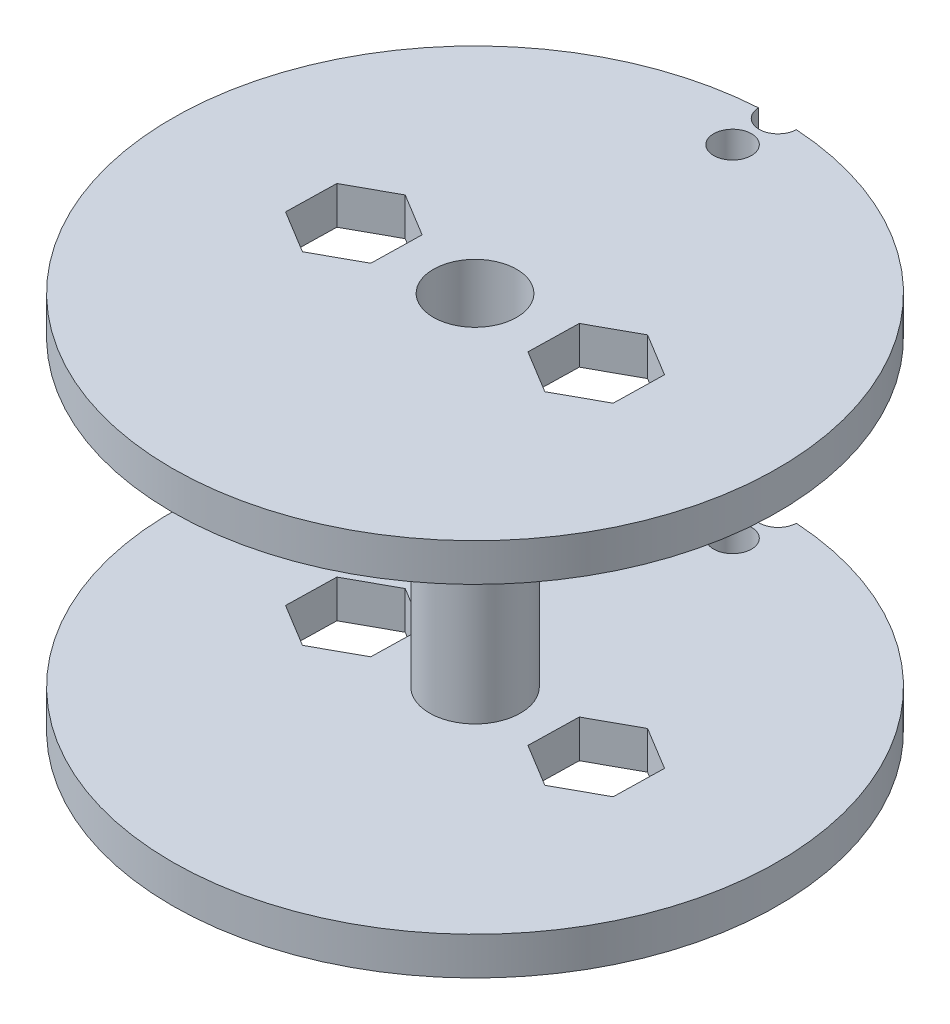
ISO-10303-21;
HEADER;
FILE_DESCRIPTION(('STEP AP214'),'2;1');
FILE_NAME('part.step','',(''),(''),'','','');
FILE_SCHEMA(('AUTOMOTIVE_DESIGN { 1 0 10303 214 1 1 1 1 }'));
ENDSEC;
DATA;
#1=APPLICATION_CONTEXT('core data for automotive mechanical design processes');
#2=APPLICATION_PROTOCOL_DEFINITION('international standard','automotive_design',2000,#1);
#3=PRODUCT_CONTEXT('',#1,'mechanical');
#4=PRODUCT('Part','Part','',(#3));
#5=PRODUCT_RELATED_PRODUCT_CATEGORY('part','',(#4));
#6=PRODUCT_DEFINITION_FORMATION('','',#4);
#7=PRODUCT_DEFINITION_CONTEXT('part definition',#1,'design');
#8=PRODUCT_DEFINITION('design','',#6,#7);
#9=PRODUCT_DEFINITION_SHAPE('','',#8);
#10=(LENGTH_UNIT() NAMED_UNIT(*) SI_UNIT(.MILLI.,.METRE.));
#11=(NAMED_UNIT(*) PLANE_ANGLE_UNIT() SI_UNIT($,.RADIAN.));
#12=(NAMED_UNIT(*) SI_UNIT($,.STERADIAN.) SOLID_ANGLE_UNIT());
#13=UNCERTAINTY_MEASURE_WITH_UNIT(LENGTH_MEASURE(1.E-05),#10,'distance_accuracy_value','');
#14=(GEOMETRIC_REPRESENTATION_CONTEXT(3) GLOBAL_UNCERTAINTY_ASSIGNED_CONTEXT((#13)) GLOBAL_UNIT_ASSIGNED_CONTEXT((#10,
#11,#12)) REPRESENTATION_CONTEXT('',''));
#15=CARTESIAN_POINT('',(0.,0.,0.));
#16=DIRECTION('',(0.,0.,1.));
#17=DIRECTION('',(1.,0.,0.));
#18=AXIS2_PLACEMENT_3D('',#15,#16,#17);
#19=CARTESIAN_POINT('',(0.,2.5,0.));
#20=DIRECTION('',(0.,1.,0.));
#21=DIRECTION('',(0.,0.,1.));
#22=AXIS2_PLACEMENT_3D('',#19,#20,#21);
#23=PLANE('',#22);
#24=DIRECTION('',(-0.0214869779830933,0.,0.999769128237692));
#25=VECTOR('',#24,1.);
#26=CARTESIAN_POINT('',(-5.08999790781407,2.5,-1.59772374233));
#27=LINE('',#26,#25);
#28=CARTESIAN_POINT('',(-5.08999790781407,2.5,-1.59772374233));
#29=VERTEX_POINT('',#28);
#30=CARTESIAN_POINT('',(-5.16132960481908,2.5,1.72127386573417));
#31=VERTEX_POINT('',#30);
#32=EDGE_CURVE('E484',#29,#31,#27,.T.);
#33=ORIENTED_EDGE('',*,*,#32,.T.);
#34=DIRECTION('',(-0.87656895196481,0.,0.48127629533493));
#35=VECTOR('',#34,1.);
#36=CARTESIAN_POINT('',(-5.16132960481908,2.5,1.72127386573417));
#37=LINE('',#36,#35);
#38=CARTESIAN_POINT('',(-8.07133169700495,2.5,3.31899760806487));
#39=VERTEX_POINT('',#38);
#40=EDGE_CURVE('E488',#31,#39,#37,.T.);
#41=ORIENTED_EDGE('',*,*,#40,.T.);
#42=DIRECTION('',(-0.855081973981716,0.,-0.518492832902762));
#43=VECTOR('',#42,1.);
#44=CARTESIAN_POINT('',(-8.07133169700495,2.5,3.31899760806487));
#45=LINE('',#44,#43);
#46=CARTESIAN_POINT('',(-10.9100020921858,2.5,1.59772374233139));
#47=VERTEX_POINT('',#46);
#48=EDGE_CURVE('E493',#39,#47,#45,.T.);
#49=ORIENTED_EDGE('',*,*,#48,.T.);
#50=DIRECTION('',(0.0214869779830943,0.,-0.999769128237692));
#51=VECTOR('',#50,1.);
#52=CARTESIAN_POINT('',(-10.9100020921858,2.5,1.59772374233139));
#53=LINE('',#52,#51);
#54=CARTESIAN_POINT('',(-10.8386703951808,2.5,-1.72127386573279));
#55=VERTEX_POINT('',#54);
#56=EDGE_CURVE('E497',#47,#55,#53,.T.);
#57=ORIENTED_EDGE('',*,*,#56,.T.);
#58=DIRECTION('',(0.87656895196481,0.,-0.48127629533493));
#59=VECTOR('',#58,1.);
#60=CARTESIAN_POINT('',(-10.8386703951808,2.5,-1.72127386573279));
#61=LINE('',#60,#59);
#62=CARTESIAN_POINT('',(-7.92866830299493,2.5,-3.31899760806348));
#63=VERTEX_POINT('',#62);
#64=EDGE_CURVE('E501',#55,#63,#61,.T.);
#65=ORIENTED_EDGE('',*,*,#64,.T.);
#66=DIRECTION('',(0.855081973981716,0.,0.518492832902762));
#67=VECTOR('',#66,1.);
#68=CARTESIAN_POINT('',(-7.92866830299493,2.5,-3.31899760806348));
#69=LINE('',#68,#67);
#70=EDGE_CURVE('E505',#63,#29,#69,.T.);
#71=ORIENTED_EDGE('',*,*,#70,.T.);
#72=EDGE_LOOP('',(#33,#41,#49,#57,#65,#71));
#73=FACE_BOUND('',#72,.T.);
#74=DIRECTION('',(0.0214869779832137,0.,-0.999769128237689));
#75=VECTOR('',#74,1.);
#76=CARTESIAN_POINT('',(5.089997907814,2.5,1.59772374233007));
#77=LINE('',#76,#75);
#78=CARTESIAN_POINT('',(5.089997907814,2.5,1.59772374233007));
#79=VERTEX_POINT('',#78);
#80=CARTESIAN_POINT('',(5.16132960481941,2.5,-1.72127386573409));
#81=VERTEX_POINT('',#80);
#82=EDGE_CURVE('E418',#79,#81,#77,.T.);
#83=ORIENTED_EDGE('',*,*,#82,.T.);
#84=DIRECTION('',(0.876568951964868,0.,-0.481276295334824));
#85=VECTOR('',#84,1.);
#86=CARTESIAN_POINT('',(5.16132960481941,2.5,-1.72127386573409));
#87=LINE('',#86,#85);
#88=CARTESIAN_POINT('',(8.07133169700547,2.5,-3.31899760806444));
#89=VERTEX_POINT('',#88);
#90=EDGE_CURVE('E422',#81,#89,#87,.T.);
#91=ORIENTED_EDGE('',*,*,#90,.T.);
#92=DIRECTION('',(0.855081973981654,0.,0.518492832902865));
#93=VECTOR('',#92,1.);
#94=CARTESIAN_POINT('',(8.07133169700547,2.5,-3.31899760806444));
#95=LINE('',#94,#93);
#96=CARTESIAN_POINT('',(10.9100020921861,2.5,-1.59772374233061));
#97=VERTEX_POINT('',#96);
#98=EDGE_CURVE('E64',#89,#97,#95,.T.);
#99=ORIENTED_EDGE('',*,*,#98,.T.);
#100=DIRECTION('',(-0.021486977983214,0.,0.999769128237689));
#101=VECTOR('',#100,1.);
#102=CARTESIAN_POINT('',(10.9100020921861,2.5,-1.59772374233061));
#103=LINE('',#102,#101);
#104=CARTESIAN_POINT('',(10.8386703951807,2.5,1.72127386573356));
#105=VERTEX_POINT('',#104);
#106=EDGE_CURVE('E429',#97,#105,#103,.T.);
#107=ORIENTED_EDGE('',*,*,#106,.T.);
#108=DIRECTION('',(-0.876568951964868,0.,0.481276295334824));
#109=VECTOR('',#108,1.);
#110=CARTESIAN_POINT('',(10.8386703951807,2.5,1.72127386573356));
#111=LINE('',#110,#109);
#112=CARTESIAN_POINT('',(7.92866830299465,2.5,3.3189976080639));
#113=VERTEX_POINT('',#112);
#114=EDGE_CURVE('E433',#105,#113,#111,.T.);
#115=ORIENTED_EDGE('',*,*,#114,.T.);
#116=DIRECTION('',(-0.855081973981654,0.,-0.518492832902865));
#117=VECTOR('',#116,1.);
#118=CARTESIAN_POINT('',(7.92866830299465,2.5,3.3189976080639));
#119=LINE('',#118,#117);
#120=EDGE_CURVE('E437',#113,#79,#119,.T.);
#121=ORIENTED_EDGE('',*,*,#120,.T.);
#122=EDGE_LOOP('',(#83,#91,#99,#107,#115,#121));
#123=FACE_BOUND('',#122,.T.);
#124=CARTESIAN_POINT('',(0.,2.5,-20.));
#125=DIRECTION('',(0.,1.,0.));
#126=DIRECTION('',(0.,0.,1.));
#127=AXIS2_PLACEMENT_3D('',#124,#125,#126);
#128=CIRCLE('',#127,1.25);
#129=CARTESIAN_POINT('',(-1.24938949935309,2.5,-19.9609375));
#130=VERTEX_POINT('',#129);
#131=CARTESIAN_POINT('',(1.24938949935309,2.5,-19.9609375));
#132=VERTEX_POINT('',#131);
#133=EDGE_CURVE('E409',#130,#132,#128,.T.);
#134=ORIENTED_EDGE('',*,*,#133,.F.);
#135=CARTESIAN_POINT('',(0.,2.5,0.));
#136=DIRECTION('',(0.,1.,0.));
#137=DIRECTION('',(0.,0.,1.));
#138=AXIS2_PLACEMENT_3D('',#135,#136,#137);
#139=CIRCLE('',#138,20.);
#140=EDGE_CURVE('E553',#130,#132,#139,.T.);
#141=ORIENTED_EDGE('',*,*,#140,.T.);
#142=EDGE_LOOP('',(#134,#141));
#143=FACE_BOUND('',#142,.T.);
#144=CARTESIAN_POINT('',(0.,2.5,-17.));
#145=DIRECTION('',(0.,1.,0.));
#146=DIRECTION('',(0.,0.,1.));
#147=AXIS2_PLACEMENT_3D('',#144,#145,#146);
#148=CIRCLE('',#147,1.25);
#149=CARTESIAN_POINT('',(0.,2.5,-15.75));
#150=VERTEX_POINT('',#149);
#151=EDGE_CURVE('E410',#150,#150,#148,.T.);
#152=ORIENTED_EDGE('',*,*,#151,.F.);
#153=EDGE_LOOP('',(#152));
#154=FACE_BOUND('',#153,.T.);
#155=CARTESIAN_POINT('',(0.,2.5,0.));
#156=DIRECTION('',(0.,1.,0.));
#157=DIRECTION('',(0.,0.,1.));
#158=AXIS2_PLACEMENT_3D('',#155,#156,#157);
#159=CIRCLE('',#158,3.);
#160=CARTESIAN_POINT('',(0.,2.5,3.));
#161=VERTEX_POINT('',#160);
#162=EDGE_CURVE('E237',#161,#161,#159,.T.);
#163=ORIENTED_EDGE('',*,*,#162,.F.);
#164=EDGE_LOOP('',(#163));
#165=FACE_BOUND('',#164,.T.);
#166=ADVANCED_FACE('F39',(#73,#123,#143,#154,#165),#23,.T.);
#167=CARTESIAN_POINT('',(0.,0.,0.));
#168=DIRECTION('',(0.,1.,0.));
#169=DIRECTION('',(0.,0.,1.));
#170=AXIS2_PLACEMENT_3D('',#167,#168,#169);
#171=PLANE('',#170);
#172=CARTESIAN_POINT('',(0.,0.,-17.));
#173=DIRECTION('',(0.,1.,0.));
#174=DIRECTION('',(0.,0.,1.));
#175=AXIS2_PLACEMENT_3D('',#172,#173,#174);
#176=CIRCLE('',#175,1.25);
#177=CARTESIAN_POINT('',(0.,0.,-15.75));
#178=VERTEX_POINT('',#177);
#179=EDGE_CURVE('E43',#178,#178,#176,.T.);
#180=ORIENTED_EDGE('',*,*,#179,.T.);
#181=EDGE_LOOP('',(#180));
#182=FACE_BOUND('',#181,.T.);
#183=DIRECTION('',(0.876568951964868,0.,-0.481276295334824));
#184=VECTOR('',#183,1.);
#185=CARTESIAN_POINT('',(5.16132960481941,0.,-1.72127386573409));
#186=LINE('',#185,#184);
#187=CARTESIAN_POINT('',(5.16132960481941,0.,-1.72127386573409));
#188=VERTEX_POINT('',#187);
#189=CARTESIAN_POINT('',(8.07133169700547,0.,-3.31899760806444));
#190=VERTEX_POINT('',#189);
#191=EDGE_CURVE('E445',#188,#190,#186,.T.);
#192=ORIENTED_EDGE('',*,*,#191,.F.);
#193=DIRECTION('',(0.0214869779832137,0.,-0.999769128237689));
#194=VECTOR('',#193,1.);
#195=CARTESIAN_POINT('',(5.089997907814,0.,1.59772374233007));
#196=LINE('',#195,#194);
#197=CARTESIAN_POINT('',(5.089997907814,0.,1.59772374233007));
#198=VERTEX_POINT('',#197);
#199=EDGE_CURVE('E442',#198,#188,#196,.T.);
#200=ORIENTED_EDGE('',*,*,#199,.F.);
#201=DIRECTION('',(-0.855081973981654,0.,-0.518492832902865));
#202=VECTOR('',#201,1.);
#203=CARTESIAN_POINT('',(7.92866830299465,0.,3.3189976080639));
#204=LINE('',#203,#202);
#205=CARTESIAN_POINT('',(7.92866830299465,0.,3.3189976080639));
#206=VERTEX_POINT('',#205);
#207=EDGE_CURVE('E423',#206,#198,#204,.T.);
#208=ORIENTED_EDGE('',*,*,#207,.F.);
#209=DIRECTION('',(-0.876568951964868,0.,0.481276295334824));
#210=VECTOR('',#209,1.);
#211=CARTESIAN_POINT('',(10.8386703951807,0.,1.72127386573356));
#212=LINE('',#211,#210);
#213=CARTESIAN_POINT('',(10.8386703951807,0.,1.72127386573356));
#214=VERTEX_POINT('',#213);
#215=EDGE_CURVE('E458',#214,#206,#212,.T.);
#216=ORIENTED_EDGE('',*,*,#215,.F.);
#217=DIRECTION('',(-0.021486977983214,0.,0.999769128237689));
#218=VECTOR('',#217,1.);
#219=CARTESIAN_POINT('',(10.9100020921861,0.,-1.59772374233061));
#220=LINE('',#219,#218);
#221=CARTESIAN_POINT('',(10.9100020921861,0.,-1.59772374233061));
#222=VERTEX_POINT('',#221);
#223=EDGE_CURVE('E454',#222,#214,#220,.T.);
#224=ORIENTED_EDGE('',*,*,#223,.F.);
#225=DIRECTION('',(0.855081973981654,0.,0.518492832902865));
#226=VECTOR('',#225,1.);
#227=CARTESIAN_POINT('',(8.07133169700547,0.,-3.31899760806444));
#228=LINE('',#227,#226);
#229=EDGE_CURVE('E450',#190,#222,#228,.T.);
#230=ORIENTED_EDGE('',*,*,#229,.F.);
#231=EDGE_LOOP('',(#192,#200,#208,#216,#224,#230));
#232=FACE_BOUND('',#231,.T.);
#233=DIRECTION('',(-0.87656895196481,0.,0.48127629533493));
#234=VECTOR('',#233,1.);
#235=CARTESIAN_POINT('',(-5.16132960481908,0.,1.72127386573417));
#236=LINE('',#235,#234);
#237=CARTESIAN_POINT('',(-5.16132960481908,0.,1.72127386573417));
#238=VERTEX_POINT('',#237);
#239=CARTESIAN_POINT('',(-8.07133169700495,0.,3.31899760806487));
#240=VERTEX_POINT('',#239);
#241=EDGE_CURVE('E513',#238,#240,#236,.T.);
#242=ORIENTED_EDGE('',*,*,#241,.F.);
#243=DIRECTION('',(-0.0214869779830933,0.,0.999769128237692));
#244=VECTOR('',#243,1.);
#245=CARTESIAN_POINT('',(-5.08999790781407,0.,-1.59772374233));
#246=LINE('',#245,#244);
#247=CARTESIAN_POINT('',(-5.08999790781407,0.,-1.59772374233));
#248=VERTEX_POINT('',#247);
#249=EDGE_CURVE('E510',#248,#238,#246,.T.);
#250=ORIENTED_EDGE('',*,*,#249,.F.);
#251=DIRECTION('',(0.855081973981716,0.,0.518492832902762));
#252=VECTOR('',#251,1.);
#253=CARTESIAN_POINT('',(-7.92866830299493,0.,-3.31899760806348));
#254=LINE('',#253,#252);
#255=CARTESIAN_POINT('',(-7.92866830299493,0.,-3.31899760806348));
#256=VERTEX_POINT('',#255);
#257=EDGE_CURVE('E489',#256,#248,#254,.T.);
#258=ORIENTED_EDGE('',*,*,#257,.F.);
#259=DIRECTION('',(0.87656895196481,0.,-0.48127629533493));
#260=VECTOR('',#259,1.);
#261=CARTESIAN_POINT('',(-10.8386703951808,0.,-1.72127386573279));
#262=LINE('',#261,#260);
#263=CARTESIAN_POINT('',(-10.8386703951808,0.,-1.72127386573279));
#264=VERTEX_POINT('',#263);
#265=EDGE_CURVE('E525',#264,#256,#262,.T.);
#266=ORIENTED_EDGE('',*,*,#265,.F.);
#267=DIRECTION('',(0.0214869779830943,0.,-0.999769128237692));
#268=VECTOR('',#267,1.);
#269=CARTESIAN_POINT('',(-10.9100020921858,0.,1.59772374233139));
#270=LINE('',#269,#268);
#271=CARTESIAN_POINT('',(-10.9100020921858,0.,1.59772374233139));
#272=VERTEX_POINT('',#271);
#273=EDGE_CURVE('E521',#272,#264,#270,.T.);
#274=ORIENTED_EDGE('',*,*,#273,.F.);
#275=DIRECTION('',(-0.855081973981716,0.,-0.518492832902762));
#276=VECTOR('',#275,1.);
#277=CARTESIAN_POINT('',(-8.07133169700495,0.,3.31899760806487));
#278=LINE('',#277,#276);
#279=EDGE_CURVE('E517',#240,#272,#278,.T.);
#280=ORIENTED_EDGE('',*,*,#279,.F.);
#281=EDGE_LOOP('',(#242,#250,#258,#266,#274,#280));
#282=FACE_BOUND('',#281,.T.);
#283=CARTESIAN_POINT('',(0.,0.,0.));
#284=DIRECTION('',(0.,1.,0.));
#285=DIRECTION('',(0.,0.,1.));
#286=AXIS2_PLACEMENT_3D('',#283,#284,#285);
#287=CIRCLE('',#286,20.);
#288=CARTESIAN_POINT('',(-1.24938949935309,0.,-19.9609375));
#289=VERTEX_POINT('',#288);
#290=CARTESIAN_POINT('',(1.24938949935308,0.,-19.9609375));
#291=VERTEX_POINT('',#290);
#292=EDGE_CURVE('E552',#289,#291,#287,.T.);
#293=ORIENTED_EDGE('',*,*,#292,.F.);
#294=CARTESIAN_POINT('',(0.,0.,-20.));
#295=DIRECTION('',(0.,1.,0.));
#296=DIRECTION('',(0.,0.,1.));
#297=AXIS2_PLACEMENT_3D('',#294,#295,#296);
#298=CIRCLE('',#297,1.25);
#299=EDGE_CURVE('E56',#289,#291,#298,.T.);
#300=ORIENTED_EDGE('',*,*,#299,.T.);
#301=EDGE_LOOP('',(#293,#300));
#302=FACE_BOUND('',#301,.T.);
#303=CARTESIAN_POINT('',(0.,0.,0.));
#304=DIRECTION('',(0.,1.,0.));
#305=DIRECTION('',(0.,0.,1.));
#306=AXIS2_PLACEMENT_3D('',#303,#304,#305);
#307=CIRCLE('',#306,2.75);
#308=CARTESIAN_POINT('',(0.,0.,2.75));
#309=VERTEX_POINT('',#308);
#310=EDGE_CURVE('E468',#309,#309,#307,.T.);
#311=ORIENTED_EDGE('',*,*,#310,.T.);
#312=EDGE_LOOP('',(#311));
#313=FACE_BOUND('',#312,.T.);
#314=ADVANCED_FACE('F566',(#182,#232,#282,#302,#313),#171,.F.);
#315=CARTESIAN_POINT('',(0.,2.5,0.));
#316=DIRECTION('',(0.,-1.,0.));
#317=DIRECTION('',(0.,0.,-1.));
#318=AXIS2_PLACEMENT_3D('',#315,#316,#317);
#319=CYLINDRICAL_SURFACE('',#318,20.);
#320=ORIENTED_EDGE('',*,*,#292,.T.);
#321=DIRECTION('',(0.,1.,0.));
#322=VECTOR('',#321,1.);
#323=CARTESIAN_POINT('',(1.24938949935309,0.,-19.9609375));
#324=LINE('',#323,#322);
#325=EDGE_CURVE('E11',#291,#132,#324,.T.);
#326=ORIENTED_EDGE('',*,*,#325,.T.);
#327=ORIENTED_EDGE('',*,*,#140,.F.);
#328=DIRECTION('',(0.,1.,0.));
#329=VECTOR('',#328,1.);
#330=CARTESIAN_POINT('',(-1.24938949935309,0.,-19.9609375));
#331=LINE('',#330,#329);
#332=EDGE_CURVE('E49',#130,#289,#331,.F.);
#333=ORIENTED_EDGE('',*,*,#332,.T.);
#334=EDGE_LOOP('',(#320,#326,#327,#333));
#335=FACE_BOUND('',#334,.T.);
#336=ADVANCED_FACE('F41',(#335),#319,.T.);
#337=CARTESIAN_POINT('',(0.,2.5,0.));
#338=DIRECTION('',(0.,-1.,0.));
#339=DIRECTION('',(0.,0.,-1.));
#340=AXIS2_PLACEMENT_3D('',#337,#338,#339);
#341=CYLINDRICAL_SURFACE('',#340,2.75);
#342=ORIENTED_EDGE('',*,*,#310,.F.);
#343=EDGE_LOOP('',(#342));
#344=FACE_BOUND('',#343,.T.);
#345=CARTESIAN_POINT('',(0.,25.,0.));
#346=DIRECTION('',(0.,1.,0.));
#347=DIRECTION('',(0.,0.,1.));
#348=AXIS2_PLACEMENT_3D('',#345,#346,#347);
#349=CIRCLE('',#348,2.75);
#350=CARTESIAN_POINT('',(0.,25.,2.75));
#351=VERTEX_POINT('',#350);
#352=EDGE_CURVE('E316',#351,#351,#349,.T.);
#353=ORIENTED_EDGE('',*,*,#352,.T.);
#354=EDGE_LOOP('',(#353));
#355=FACE_BOUND('',#354,.T.);
#356=ADVANCED_FACE('F572',(#344,#355),#341,.F.);
#357=CARTESIAN_POINT('',(-5.08999790781407,2.5,-1.59772374233));
#358=DIRECTION('',(0.999769128237692,0.,0.0214869779830933));
#359=DIRECTION('',(0.0214869779830933,0.,-0.999769128237692));
#360=AXIS2_PLACEMENT_3D('',#357,#358,#359);
#361=PLANE('',#360);
#362=ORIENTED_EDGE('',*,*,#249,.T.);
#363=DIRECTION('',(0.,-1.,0.));
#364=VECTOR('',#363,1.);
#365=CARTESIAN_POINT('',(-5.16132960481908,2.5,1.72127386573417));
#366=LINE('',#365,#364);
#367=EDGE_CURVE('E509',#31,#238,#366,.T.);
#368=ORIENTED_EDGE('',*,*,#367,.F.);
#369=ORIENTED_EDGE('',*,*,#32,.F.);
#370=DIRECTION('',(0.,-1.,0.));
#371=VECTOR('',#370,1.);
#372=CARTESIAN_POINT('',(-5.08999790781407,2.5,-1.59772374233));
#373=LINE('',#372,#371);
#374=EDGE_CURVE('E446',#29,#248,#373,.T.);
#375=ORIENTED_EDGE('',*,*,#374,.T.);
#376=EDGE_LOOP('',(#362,#368,#369,#375));
#377=FACE_BOUND('',#376,.T.);
#378=ADVANCED_FACE('F575',(#377),#361,.F.);
#379=CARTESIAN_POINT('',(-7.92866830299493,2.5,-3.31899760806348));
#380=DIRECTION('',(0.518492832902762,0.,-0.855081973981716));
#381=DIRECTION('',(-0.855081973981716,0.,-0.518492832902762));
#382=AXIS2_PLACEMENT_3D('',#379,#380,#381);
#383=PLANE('',#382);
#384=ORIENTED_EDGE('',*,*,#257,.T.);
#385=ORIENTED_EDGE('',*,*,#374,.F.);
#386=ORIENTED_EDGE('',*,*,#70,.F.);
#387=DIRECTION('',(0.,-1.,0.));
#388=VECTOR('',#387,1.);
#389=CARTESIAN_POINT('',(-7.92866830299493,2.5,-3.31899760806348));
#390=LINE('',#389,#388);
#391=EDGE_CURVE('E534',#63,#256,#390,.T.);
#392=ORIENTED_EDGE('',*,*,#391,.T.);
#393=EDGE_LOOP('',(#384,#385,#386,#392));
#394=FACE_BOUND('',#393,.T.);
#395=ADVANCED_FACE('F603',(#394),#383,.F.);
#396=CARTESIAN_POINT('',(-10.8386703951808,2.5,-1.72127386573279));
#397=DIRECTION('',(-0.48127629533493,0.,-0.87656895196481));
#398=DIRECTION('',(-0.87656895196481,0.,0.48127629533493));
#399=AXIS2_PLACEMENT_3D('',#396,#397,#398);
#400=PLANE('',#399);
#401=ORIENTED_EDGE('',*,*,#265,.T.);
#402=ORIENTED_EDGE('',*,*,#391,.F.);
#403=ORIENTED_EDGE('',*,*,#64,.F.);
#404=DIRECTION('',(0.,-1.,0.));
#405=VECTOR('',#404,1.);
#406=CARTESIAN_POINT('',(-10.8386703951808,2.5,-1.72127386573279));
#407=LINE('',#406,#405);
#408=EDGE_CURVE('E537',#55,#264,#407,.T.);
#409=ORIENTED_EDGE('',*,*,#408,.T.);
#410=EDGE_LOOP('',(#401,#402,#403,#409));
#411=FACE_BOUND('',#410,.T.);
#412=ADVANCED_FACE('F617',(#411),#400,.F.);
#413=CARTESIAN_POINT('',(-10.9100020921858,2.5,1.59772374233139));
#414=DIRECTION('',(-0.999769128237692,0.,-0.0214869779830943));
#415=DIRECTION('',(-0.0214869779830943,0.,0.999769128237692));
#416=AXIS2_PLACEMENT_3D('',#413,#414,#415);
#417=PLANE('',#416);
#418=ORIENTED_EDGE('',*,*,#273,.T.);
#419=ORIENTED_EDGE('',*,*,#408,.F.);
#420=ORIENTED_EDGE('',*,*,#56,.F.);
#421=DIRECTION('',(0.,-1.,0.));
#422=VECTOR('',#421,1.);
#423=CARTESIAN_POINT('',(-10.9100020921858,2.5,1.59772374233139));
#424=LINE('',#423,#422);
#425=EDGE_CURVE('E540',#47,#272,#424,.T.);
#426=ORIENTED_EDGE('',*,*,#425,.T.);
#427=EDGE_LOOP('',(#418,#419,#420,#426));
#428=FACE_BOUND('',#427,.T.);
#429=ADVANCED_FACE('F613',(#428),#417,.F.);
#430=CARTESIAN_POINT('',(-8.07133169700495,2.5,3.31899760806487));
#431=DIRECTION('',(-0.518492832902762,0.,0.855081973981716));
#432=DIRECTION('',(0.855081973981716,0.,0.518492832902762));
#433=AXIS2_PLACEMENT_3D('',#430,#431,#432);
#434=PLANE('',#433);
#435=ORIENTED_EDGE('',*,*,#279,.T.);
#436=ORIENTED_EDGE('',*,*,#425,.F.);
#437=ORIENTED_EDGE('',*,*,#48,.F.);
#438=DIRECTION('',(0.,-1.,0.));
#439=VECTOR('',#438,1.);
#440=CARTESIAN_POINT('',(-8.07133169700495,2.5,3.31899760806487));
#441=LINE('',#440,#439);
#442=EDGE_CURVE('E543',#39,#240,#441,.T.);
#443=ORIENTED_EDGE('',*,*,#442,.T.);
#444=EDGE_LOOP('',(#435,#436,#437,#443));
#445=FACE_BOUND('',#444,.T.);
#446=ADVANCED_FACE('F609',(#445),#434,.F.);
#447=CARTESIAN_POINT('',(-5.16132960481908,2.5,1.72127386573417));
#448=DIRECTION('',(0.48127629533493,0.,0.87656895196481));
#449=DIRECTION('',(0.87656895196481,0.,-0.48127629533493));
#450=AXIS2_PLACEMENT_3D('',#447,#448,#449);
#451=PLANE('',#450);
#452=ORIENTED_EDGE('',*,*,#241,.T.);
#453=ORIENTED_EDGE('',*,*,#442,.F.);
#454=ORIENTED_EDGE('',*,*,#40,.F.);
#455=ORIENTED_EDGE('',*,*,#367,.T.);
#456=EDGE_LOOP('',(#452,#453,#454,#455));
#457=FACE_BOUND('',#456,.T.);
#458=ADVANCED_FACE('F605',(#457),#451,.F.);
#459=CARTESIAN_POINT('',(5.089997907814,2.5,1.59772374233007));
#460=DIRECTION('',(-0.999769128237689,0.,-0.0214869779832137));
#461=DIRECTION('',(-0.0214869779832137,0.,0.999769128237689));
#462=AXIS2_PLACEMENT_3D('',#459,#460,#461);
#463=PLANE('',#462);
#464=ORIENTED_EDGE('',*,*,#199,.T.);
#465=DIRECTION('',(0.,-1.,0.));
#466=VECTOR('',#465,1.);
#467=CARTESIAN_POINT('',(5.16132960481941,2.5,-1.72127386573409));
#468=LINE('',#467,#466);
#469=EDGE_CURVE('E441',#81,#188,#468,.T.);
#470=ORIENTED_EDGE('',*,*,#469,.F.);
#471=ORIENTED_EDGE('',*,*,#82,.F.);
#472=DIRECTION('',(0.,-1.,0.));
#473=VECTOR('',#472,1.);
#474=CARTESIAN_POINT('',(5.089997907814,2.5,1.59772374233007));
#475=LINE('',#474,#473);
#476=EDGE_CURVE('E465',#79,#198,#475,.T.);
#477=ORIENTED_EDGE('',*,*,#476,.T.);
#478=EDGE_LOOP('',(#464,#470,#471,#477));
#479=FACE_BOUND('',#478,.T.);
#480=ADVANCED_FACE('F608',(#479),#463,.F.);
#481=CARTESIAN_POINT('',(7.92866830299465,2.5,3.3189976080639));
#482=DIRECTION('',(-0.518492832902865,0.,0.855081973981654));
#483=DIRECTION('',(0.855081973981654,0.,0.518492832902865));
#484=AXIS2_PLACEMENT_3D('',#481,#482,#483);
#485=PLANE('',#484);
#486=ORIENTED_EDGE('',*,*,#207,.T.);
#487=ORIENTED_EDGE('',*,*,#476,.F.);
#488=ORIENTED_EDGE('',*,*,#120,.F.);
#489=DIRECTION('',(0.,-1.,0.));
#490=VECTOR('',#489,1.);
#491=CARTESIAN_POINT('',(7.92866830299465,2.5,3.3189976080639));
#492=LINE('',#491,#490);
#493=EDGE_CURVE('E469',#113,#206,#492,.T.);
#494=ORIENTED_EDGE('',*,*,#493,.T.);
#495=EDGE_LOOP('',(#486,#487,#488,#494));
#496=FACE_BOUND('',#495,.T.);
#497=ADVANCED_FACE('F627',(#496),#485,.F.);
#498=CARTESIAN_POINT('',(10.8386703951807,2.5,1.72127386573356));
#499=DIRECTION('',(0.481276295334824,0.,0.876568951964868));
#500=DIRECTION('',(0.876568951964868,0.,-0.481276295334824));
#501=AXIS2_PLACEMENT_3D('',#498,#499,#500);
#502=PLANE('',#501);
#503=ORIENTED_EDGE('',*,*,#215,.T.);
#504=ORIENTED_EDGE('',*,*,#493,.F.);
#505=ORIENTED_EDGE('',*,*,#114,.F.);
#506=DIRECTION('',(0.,-1.,0.));
#507=VECTOR('',#506,1.);
#508=CARTESIAN_POINT('',(10.8386703951807,2.5,1.72127386573356));
#509=LINE('',#508,#507);
#510=EDGE_CURVE('E472',#105,#214,#509,.T.);
#511=ORIENTED_EDGE('',*,*,#510,.T.);
#512=EDGE_LOOP('',(#503,#504,#505,#511));
#513=FACE_BOUND('',#512,.T.);
#514=ADVANCED_FACE('F640',(#513),#502,.F.);
#515=CARTESIAN_POINT('',(10.9100020921861,2.5,-1.59772374233061));
#516=DIRECTION('',(0.999769128237689,0.,0.021486977983214));
#517=DIRECTION('',(0.021486977983214,0.,-0.999769128237689));
#518=AXIS2_PLACEMENT_3D('',#515,#516,#517);
#519=PLANE('',#518);
#520=ORIENTED_EDGE('',*,*,#223,.T.);
#521=ORIENTED_EDGE('',*,*,#510,.F.);
#522=ORIENTED_EDGE('',*,*,#106,.F.);
#523=DIRECTION('',(0.,-1.,0.));
#524=VECTOR('',#523,1.);
#525=CARTESIAN_POINT('',(10.9100020921861,2.5,-1.59772374233061));
#526=LINE('',#525,#524);
#527=EDGE_CURVE('E475',#97,#222,#526,.T.);
#528=ORIENTED_EDGE('',*,*,#527,.T.);
#529=EDGE_LOOP('',(#520,#521,#522,#528));
#530=FACE_BOUND('',#529,.T.);
#531=ADVANCED_FACE('F637',(#530),#519,.F.);
#532=CARTESIAN_POINT('',(8.07133169700547,2.5,-3.31899760806444));
#533=DIRECTION('',(0.518492832902865,0.,-0.855081973981654));
#534=DIRECTION('',(-0.855081973981654,0.,-0.518492832902865));
#535=AXIS2_PLACEMENT_3D('',#532,#533,#534);
#536=PLANE('',#535);
#537=ORIENTED_EDGE('',*,*,#229,.T.);
#538=ORIENTED_EDGE('',*,*,#527,.F.);
#539=ORIENTED_EDGE('',*,*,#98,.F.);
#540=DIRECTION('',(0.,-1.,0.));
#541=VECTOR('',#540,1.);
#542=CARTESIAN_POINT('',(8.07133169700547,2.5,-3.31899760806444));
#543=LINE('',#542,#541);
#544=EDGE_CURVE('E478',#89,#190,#543,.T.);
#545=ORIENTED_EDGE('',*,*,#544,.T.);
#546=EDGE_LOOP('',(#537,#538,#539,#545));
#547=FACE_BOUND('',#546,.T.);
#548=ADVANCED_FACE('F633',(#547),#536,.F.);
#549=CARTESIAN_POINT('',(5.16132960481941,2.5,-1.72127386573409));
#550=DIRECTION('',(-0.481276295334824,0.,-0.876568951964868));
#551=DIRECTION('',(-0.876568951964868,0.,0.481276295334825));
#552=AXIS2_PLACEMENT_3D('',#549,#550,#551);
#553=PLANE('',#552);
#554=ORIENTED_EDGE('',*,*,#191,.T.);
#555=ORIENTED_EDGE('',*,*,#544,.F.);
#556=ORIENTED_EDGE('',*,*,#90,.F.);
#557=ORIENTED_EDGE('',*,*,#469,.T.);
#558=EDGE_LOOP('',(#554,#555,#556,#557));
#559=FACE_BOUND('',#558,.T.);
#560=ADVANCED_FACE('F629',(#559),#553,.F.);
#561=CARTESIAN_POINT('',(0.,-2.5,-20.));
#562=DIRECTION('',(0.,1.,0.));
#563=DIRECTION('',(0.,0.,1.));
#564=AXIS2_PLACEMENT_3D('',#561,#562,#563);
#565=CYLINDRICAL_SURFACE('',#564,1.25);
#566=ORIENTED_EDGE('',*,*,#299,.F.);
#567=ORIENTED_EDGE('',*,*,#332,.F.);
#568=ORIENTED_EDGE('',*,*,#133,.T.);
#569=ORIENTED_EDGE('',*,*,#325,.F.);
#570=EDGE_LOOP('',(#566,#567,#568,#569));
#571=FACE_BOUND('',#570,.T.);
#572=ADVANCED_FACE('F632',(#571),#565,.F.);
#573=CARTESIAN_POINT('',(0.,-2.5,-17.));
#574=DIRECTION('',(0.,1.,0.));
#575=DIRECTION('',(0.,0.,1.));
#576=AXIS2_PLACEMENT_3D('',#573,#574,#575);
#577=CYLINDRICAL_SURFACE('',#576,1.25);
#578=ORIENTED_EDGE('',*,*,#151,.T.);
#579=EDGE_LOOP('',(#578));
#580=FACE_BOUND('',#579,.T.);
#581=ORIENTED_EDGE('',*,*,#179,.F.);
#582=EDGE_LOOP('',(#581));
#583=FACE_BOUND('',#582,.T.);
#584=ADVANCED_FACE('F650',(#580,#583),#577,.F.);
#585=CARTESIAN_POINT('',(0.,12.5,0.));
#586=DIRECTION('',(0.,-1.,0.));
#587=DIRECTION('',(0.,0.,-1.));
#588=AXIS2_PLACEMENT_3D('',#585,#586,#587);
#589=CYLINDRICAL_SURFACE('',#588,3.);
#590=ORIENTED_EDGE('',*,*,#162,.T.);
#591=EDGE_LOOP('',(#590));
#592=FACE_BOUND('',#591,.T.);
#593=CARTESIAN_POINT('',(0.,22.5,0.));
#594=DIRECTION('',(0.,1.,0.));
#595=DIRECTION('',(0.,0.,1.));
#596=AXIS2_PLACEMENT_3D('',#593,#594,#595);
#597=CIRCLE('',#596,3.);
#598=CARTESIAN_POINT('',(0.,22.5,3.));
#599=VERTEX_POINT('',#598);
#600=EDGE_CURVE('E251',#599,#599,#597,.T.);
#601=ORIENTED_EDGE('',*,*,#600,.F.);
#602=EDGE_LOOP('',(#601));
#603=FACE_BOUND('',#602,.T.);
#604=ADVANCED_FACE('F589',(#592,#603),#589,.T.);
#605=CARTESIAN_POINT('',(0.,22.5,0.));
#606=DIRECTION('',(0.,-1.,0.));
#607=DIRECTION('',(0.,0.,1.));
#608=AXIS2_PLACEMENT_3D('',#605,#606,#607);
#609=PLANE('',#608);
#610=DIRECTION('',(-0.0214869779830933,0.,0.999769128237692));
#611=VECTOR('',#610,1.);
#612=CARTESIAN_POINT('',(-5.08999790781407,22.5,-1.59772374233));
#613=LINE('',#612,#611);
#614=CARTESIAN_POINT('',(-5.08999790781407,22.5,-1.59772374233));
#615=VERTEX_POINT('',#614);
#616=CARTESIAN_POINT('',(-5.16132960481908,22.5,1.72127386573417));
#617=VERTEX_POINT('',#616);
#618=EDGE_CURVE('E331',#615,#617,#613,.T.);
#619=ORIENTED_EDGE('',*,*,#618,.F.);
#620=DIRECTION('',(0.855081973981716,0.,0.518492832902762));
#621=VECTOR('',#620,1.);
#622=CARTESIAN_POINT('',(-7.92866830299493,22.5,-3.31899760806348));
#623=LINE('',#622,#621);
#624=CARTESIAN_POINT('',(-7.92866830299493,22.5,-3.31899760806348));
#625=VERTEX_POINT('',#624);
#626=EDGE_CURVE('E352',#625,#615,#623,.T.);
#627=ORIENTED_EDGE('',*,*,#626,.F.);
#628=DIRECTION('',(0.87656895196481,0.,-0.48127629533493));
#629=VECTOR('',#628,1.);
#630=CARTESIAN_POINT('',(-10.8386703951808,22.5,-1.72127386573279));
#631=LINE('',#630,#629);
#632=CARTESIAN_POINT('',(-10.8386703951808,22.5,-1.72127386573279));
#633=VERTEX_POINT('',#632);
#634=EDGE_CURVE('E348',#633,#625,#631,.T.);
#635=ORIENTED_EDGE('',*,*,#634,.F.);
#636=DIRECTION('',(0.0214869779830943,0.,-0.999769128237692));
#637=VECTOR('',#636,1.);
#638=CARTESIAN_POINT('',(-10.9100020921858,22.5,1.59772374233139));
#639=LINE('',#638,#637);
#640=CARTESIAN_POINT('',(-10.9100020921858,22.5,1.59772374233139));
#641=VERTEX_POINT('',#640);
#642=EDGE_CURVE('E344',#641,#633,#639,.T.);
#643=ORIENTED_EDGE('',*,*,#642,.F.);
#644=DIRECTION('',(-0.855081973981716,0.,-0.518492832902762));
#645=VECTOR('',#644,1.);
#646=CARTESIAN_POINT('',(-8.07133169700495,22.5,3.31899760806487));
#647=LINE('',#646,#645);
#648=CARTESIAN_POINT('',(-8.07133169700495,22.5,3.31899760806487));
#649=VERTEX_POINT('',#648);
#650=EDGE_CURVE('E340',#649,#641,#647,.T.);
#651=ORIENTED_EDGE('',*,*,#650,.F.);
#652=DIRECTION('',(-0.87656895196481,0.,0.48127629533493));
#653=VECTOR('',#652,1.);
#654=CARTESIAN_POINT('',(-5.16132960481908,22.5,1.72127386573417));
#655=LINE('',#654,#653);
#656=EDGE_CURVE('E335',#617,#649,#655,.T.);
#657=ORIENTED_EDGE('',*,*,#656,.F.);
#658=EDGE_LOOP('',(#619,#627,#635,#643,#651,#657));
#659=FACE_BOUND('',#658,.T.);
#660=DIRECTION('',(0.0214869779832137,0.,-0.999769128237689));
#661=VECTOR('',#660,1.);
#662=CARTESIAN_POINT('',(5.089997907814,22.5,1.59772374233007));
#663=LINE('',#662,#661);
#664=CARTESIAN_POINT('',(5.089997907814,22.5,1.59772374233007));
#665=VERTEX_POINT('',#664);
#666=CARTESIAN_POINT('',(5.16132960481941,22.5,-1.72127386573409));
#667=VERTEX_POINT('',#666);
#668=EDGE_CURVE('E263',#665,#667,#663,.T.);
#669=ORIENTED_EDGE('',*,*,#668,.F.);
#670=DIRECTION('',(-0.855081973981654,0.,-0.518492832902865));
#671=VECTOR('',#670,1.);
#672=CARTESIAN_POINT('',(7.92866830299465,22.5,3.3189976080639));
#673=LINE('',#672,#671);
#674=CARTESIAN_POINT('',(7.92866830299465,22.5,3.3189976080639));
#675=VERTEX_POINT('',#674);
#676=EDGE_CURVE('E284',#675,#665,#673,.T.);
#677=ORIENTED_EDGE('',*,*,#676,.F.);
#678=DIRECTION('',(-0.876568951964868,0.,0.481276295334824));
#679=VECTOR('',#678,1.);
#680=CARTESIAN_POINT('',(10.8386703951807,22.5,1.72127386573356));
#681=LINE('',#680,#679);
#682=CARTESIAN_POINT('',(10.8386703951807,22.5,1.72127386573356));
#683=VERTEX_POINT('',#682);
#684=EDGE_CURVE('E280',#683,#675,#681,.T.);
#685=ORIENTED_EDGE('',*,*,#684,.F.);
#686=DIRECTION('',(-0.021486977983214,0.,0.999769128237689));
#687=VECTOR('',#686,1.);
#688=CARTESIAN_POINT('',(10.9100020921861,22.5,-1.59772374233061));
#689=LINE('',#688,#687);
#690=CARTESIAN_POINT('',(10.9100020921861,22.5,-1.59772374233061));
#691=VERTEX_POINT('',#690);
#692=EDGE_CURVE('E276',#691,#683,#689,.T.);
#693=ORIENTED_EDGE('',*,*,#692,.F.);
#694=DIRECTION('',(0.855081973981654,0.,0.518492832902865));
#695=VECTOR('',#694,1.);
#696=CARTESIAN_POINT('',(8.07133169700547,22.5,-3.31899760806444));
#697=LINE('',#696,#695);
#698=CARTESIAN_POINT('',(8.07133169700547,22.5,-3.31899760806444));
#699=VERTEX_POINT('',#698);
#700=EDGE_CURVE('E272',#699,#691,#697,.T.);
#701=ORIENTED_EDGE('',*,*,#700,.F.);
#702=DIRECTION('',(0.876568951964868,0.,-0.481276295334824));
#703=VECTOR('',#702,1.);
#704=CARTESIAN_POINT('',(5.16132960481941,22.5,-1.72127386573409));
#705=LINE('',#704,#703);
#706=EDGE_CURVE('E267',#667,#699,#705,.T.);
#707=ORIENTED_EDGE('',*,*,#706,.F.);
#708=EDGE_LOOP('',(#669,#677,#685,#693,#701,#707));
#709=FACE_BOUND('',#708,.T.);
#710=CARTESIAN_POINT('',(0.,22.5,-20.));
#711=DIRECTION('',(0.,1.,0.));
#712=DIRECTION('',(0.,0.,1.));
#713=AXIS2_PLACEMENT_3D('',#710,#711,#712);
#714=CIRCLE('',#713,1.25);
#715=CARTESIAN_POINT('',(-1.24938949935309,22.5,-19.9609375));
#716=VERTEX_POINT('',#715);
#717=CARTESIAN_POINT('',(1.24938949935309,22.5,-19.9609375));
#718=VERTEX_POINT('',#717);
#719=EDGE_CURVE('E230',#716,#718,#714,.T.);
#720=ORIENTED_EDGE('',*,*,#719,.T.);
#721=CARTESIAN_POINT('',(0.,22.5,0.));
#722=DIRECTION('',(0.,1.,0.));
#723=DIRECTION('',(0.,0.,1.));
#724=AXIS2_PLACEMENT_3D('',#721,#722,#723);
#725=CIRCLE('',#724,20.);
#726=EDGE_CURVE('E241',#716,#718,#725,.T.);
#727=ORIENTED_EDGE('',*,*,#726,.F.);
#728=EDGE_LOOP('',(#720,#727));
#729=FACE_BOUND('',#728,.T.);
#730=CARTESIAN_POINT('',(0.,22.5,-17.));
#731=DIRECTION('',(0.,1.,0.));
#732=DIRECTION('',(0.,0.,1.));
#733=AXIS2_PLACEMENT_3D('',#730,#731,#732);
#734=CIRCLE('',#733,1.25);
#735=CARTESIAN_POINT('',(0.,22.5,-15.75));
#736=VERTEX_POINT('',#735);
#737=EDGE_CURVE('E250',#736,#736,#734,.T.);
#738=ORIENTED_EDGE('',*,*,#737,.T.);
#739=EDGE_LOOP('',(#738));
#740=FACE_BOUND('',#739,.T.);
#741=ORIENTED_EDGE('',*,*,#600,.T.);
#742=EDGE_LOOP('',(#741));
#743=FACE_BOUND('',#742,.T.);
#744=ADVANCED_FACE('F247',(#659,#709,#729,#740,#743),#609,.T.);
#745=CARTESIAN_POINT('',(0.,25.,0.));
#746=DIRECTION('',(0.,-1.,0.));
#747=DIRECTION('',(0.,0.,1.));
#748=AXIS2_PLACEMENT_3D('',#745,#746,#747);
#749=PLANE('',#748);
#750=CARTESIAN_POINT('',(0.,25.,-17.));
#751=DIRECTION('',(0.,1.,0.));
#752=DIRECTION('',(0.,0.,1.));
#753=AXIS2_PLACEMENT_3D('',#750,#751,#752);
#754=CIRCLE('',#753,1.25);
#755=CARTESIAN_POINT('',(0.,25.,-15.75));
#756=VERTEX_POINT('',#755);
#757=EDGE_CURVE('E262',#756,#756,#754,.T.);
#758=ORIENTED_EDGE('',*,*,#757,.F.);
#759=EDGE_LOOP('',(#758));
#760=FACE_BOUND('',#759,.T.);
#761=DIRECTION('',(0.876568951964868,0.,-0.481276295334824));
#762=VECTOR('',#761,1.);
#763=CARTESIAN_POINT('',(5.16132960481941,25.,-1.72127386573409));
#764=LINE('',#763,#762);
#765=CARTESIAN_POINT('',(5.16132960481941,25.,-1.72127386573409));
#766=VERTEX_POINT('',#765);
#767=CARTESIAN_POINT('',(8.07133169700547,25.,-3.31899760806444));
#768=VERTEX_POINT('',#767);
#769=EDGE_CURVE('E293',#766,#768,#764,.T.);
#770=ORIENTED_EDGE('',*,*,#769,.T.);
#771=DIRECTION('',(0.855081973981654,0.,0.518492832902865));
#772=VECTOR('',#771,1.);
#773=CARTESIAN_POINT('',(8.07133169700547,25.,-3.31899760806444));
#774=LINE('',#773,#772);
#775=CARTESIAN_POINT('',(10.9100020921861,25.,-1.59772374233061));
#776=VERTEX_POINT('',#775);
#777=EDGE_CURVE('E298',#768,#776,#774,.T.);
#778=ORIENTED_EDGE('',*,*,#777,.T.);
#779=DIRECTION('',(-0.021486977983214,0.,0.999769128237689));
#780=VECTOR('',#779,1.);
#781=CARTESIAN_POINT('',(10.9100020921861,25.,-1.59772374233061));
#782=LINE('',#781,#780);
#783=CARTESIAN_POINT('',(10.8386703951807,25.,1.72127386573356));
#784=VERTEX_POINT('',#783);
#785=EDGE_CURVE('E302',#776,#784,#782,.T.);
#786=ORIENTED_EDGE('',*,*,#785,.T.);
#787=DIRECTION('',(-0.876568951964868,0.,0.481276295334824));
#788=VECTOR('',#787,1.);
#789=CARTESIAN_POINT('',(10.8386703951807,25.,1.72127386573356));
#790=LINE('',#789,#788);
#791=CARTESIAN_POINT('',(7.92866830299465,25.,3.3189976080639));
#792=VERTEX_POINT('',#791);
#793=EDGE_CURVE('E306',#784,#792,#790,.T.);
#794=ORIENTED_EDGE('',*,*,#793,.T.);
#795=DIRECTION('',(-0.855081973981654,0.,-0.518492832902865));
#796=VECTOR('',#795,1.);
#797=CARTESIAN_POINT('',(7.92866830299465,25.,3.3189976080639));
#798=LINE('',#797,#796);
#799=CARTESIAN_POINT('',(5.089997907814,25.,1.59772374233007));
#800=VERTEX_POINT('',#799);
#801=EDGE_CURVE('E268',#792,#800,#798,.T.);
#802=ORIENTED_EDGE('',*,*,#801,.T.);
#803=DIRECTION('',(0.0214869779832137,0.,-0.999769128237689));
#804=VECTOR('',#803,1.);
#805=CARTESIAN_POINT('',(5.089997907814,25.,1.59772374233007));
#806=LINE('',#805,#804);
#807=EDGE_CURVE('E289',#800,#766,#806,.T.);
#808=ORIENTED_EDGE('',*,*,#807,.T.);
#809=EDGE_LOOP('',(#770,#778,#786,#794,#802,#808));
#810=FACE_BOUND('',#809,.T.);
#811=DIRECTION('',(-0.87656895196481,0.,0.48127629533493));
#812=VECTOR('',#811,1.);
#813=CARTESIAN_POINT('',(-5.16132960481908,25.,1.72127386573417));
#814=LINE('',#813,#812);
#815=CARTESIAN_POINT('',(-5.16132960481908,25.,1.72127386573417));
#816=VERTEX_POINT('',#815);
#817=CARTESIAN_POINT('',(-8.07133169700495,25.,3.31899760806487));
#818=VERTEX_POINT('',#817);
#819=EDGE_CURVE('E361',#816,#818,#814,.T.);
#820=ORIENTED_EDGE('',*,*,#819,.T.);
#821=DIRECTION('',(-0.855081973981716,0.,-0.518492832902762));
#822=VECTOR('',#821,1.);
#823=CARTESIAN_POINT('',(-8.07133169700495,25.,3.31899760806487));
#824=LINE('',#823,#822);
#825=CARTESIAN_POINT('',(-10.9100020921858,25.,1.59772374233139));
#826=VERTEX_POINT('',#825);
#827=EDGE_CURVE('E365',#818,#826,#824,.T.);
#828=ORIENTED_EDGE('',*,*,#827,.T.);
#829=DIRECTION('',(0.0214869779830943,0.,-0.999769128237692));
#830=VECTOR('',#829,1.);
#831=CARTESIAN_POINT('',(-10.9100020921858,25.,1.59772374233139));
#832=LINE('',#831,#830);
#833=CARTESIAN_POINT('',(-10.8386703951808,25.,-1.72127386573279));
#834=VERTEX_POINT('',#833);
#835=EDGE_CURVE('E369',#826,#834,#832,.T.);
#836=ORIENTED_EDGE('',*,*,#835,.T.);
#837=DIRECTION('',(0.87656895196481,0.,-0.48127629533493));
#838=VECTOR('',#837,1.);
#839=CARTESIAN_POINT('',(-10.8386703951808,25.,-1.72127386573279));
#840=LINE('',#839,#838);
#841=CARTESIAN_POINT('',(-7.92866830299493,25.,-3.31899760806348));
#842=VERTEX_POINT('',#841);
#843=EDGE_CURVE('E373',#834,#842,#840,.T.);
#844=ORIENTED_EDGE('',*,*,#843,.T.);
#845=DIRECTION('',(0.855081973981716,0.,0.518492832902762));
#846=VECTOR('',#845,1.);
#847=CARTESIAN_POINT('',(-7.92866830299493,25.,-3.31899760806348));
#848=LINE('',#847,#846);
#849=CARTESIAN_POINT('',(-5.08999790781407,25.,-1.59772374233));
#850=VERTEX_POINT('',#849);
#851=EDGE_CURVE('E336',#842,#850,#848,.T.);
#852=ORIENTED_EDGE('',*,*,#851,.T.);
#853=DIRECTION('',(-0.0214869779830933,0.,0.999769128237692));
#854=VECTOR('',#853,1.);
#855=CARTESIAN_POINT('',(-5.08999790781407,25.,-1.59772374233));
#856=LINE('',#855,#854);
#857=EDGE_CURVE('E357',#850,#816,#856,.T.);
#858=ORIENTED_EDGE('',*,*,#857,.T.);
#859=EDGE_LOOP('',(#820,#828,#836,#844,#852,#858));
#860=FACE_BOUND('',#859,.T.);
#861=CARTESIAN_POINT('',(0.,25.,0.));
#862=DIRECTION('',(0.,1.,0.));
#863=DIRECTION('',(0.,0.,1.));
#864=AXIS2_PLACEMENT_3D('',#861,#862,#863);
#865=CIRCLE('',#864,20.);
#866=CARTESIAN_POINT('',(-1.24938949935309,25.,-19.9609375));
#867=VERTEX_POINT('',#866);
#868=CARTESIAN_POINT('',(1.24938949935308,25.,-19.9609375));
#869=VERTEX_POINT('',#868);
#870=EDGE_CURVE('E245',#867,#869,#865,.T.);
#871=ORIENTED_EDGE('',*,*,#870,.T.);
#872=CARTESIAN_POINT('',(0.,25.,-20.));
#873=DIRECTION('',(0.,1.,0.));
#874=DIRECTION('',(0.,0.,1.));
#875=AXIS2_PLACEMENT_3D('',#872,#873,#874);
#876=CIRCLE('',#875,1.25);
#877=EDGE_CURVE('E232',#867,#869,#876,.T.);
#878=ORIENTED_EDGE('',*,*,#877,.F.);
#879=EDGE_LOOP('',(#871,#878));
#880=FACE_BOUND('',#879,.T.);
#881=ORIENTED_EDGE('',*,*,#352,.F.);
#882=EDGE_LOOP('',(#881));
#883=FACE_BOUND('',#882,.T.);
#884=ADVANCED_FACE('F579',(#760,#810,#860,#880,#883),#749,.F.);
#885=CARTESIAN_POINT('',(0.,22.5,0.));
#886=DIRECTION('',(0.,1.,0.));
#887=DIRECTION('',(0.,0.,-1.));
#888=AXIS2_PLACEMENT_3D('',#885,#886,#887);
#889=CYLINDRICAL_SURFACE('',#888,20.);
#890=ORIENTED_EDGE('',*,*,#870,.F.);
#891=DIRECTION('',(0.,-1.,0.));
#892=VECTOR('',#891,1.);
#893=CARTESIAN_POINT('',(-1.24938949935309,25.,-19.9609375));
#894=LINE('',#893,#892);
#895=EDGE_CURVE('E238',#716,#867,#894,.F.);
#896=ORIENTED_EDGE('',*,*,#895,.F.);
#897=ORIENTED_EDGE('',*,*,#726,.T.);
#898=DIRECTION('',(0.,-1.,0.));
#899=VECTOR('',#898,1.);
#900=CARTESIAN_POINT('',(1.24938949935309,25.,-19.9609375));
#901=LINE('',#900,#899);
#902=EDGE_CURVE('E226',#869,#718,#901,.T.);
#903=ORIENTED_EDGE('',*,*,#902,.F.);
#904=EDGE_LOOP('',(#890,#896,#897,#903));
#905=FACE_BOUND('',#904,.T.);
#906=ADVANCED_FACE('F242',(#905),#889,.T.);
#907=CARTESIAN_POINT('',(-5.08999790781407,22.5,-1.59772374233));
#908=DIRECTION('',(0.999769128237692,0.,0.0214869779830933));
#909=DIRECTION('',(0.0214869779830933,0.,-0.999769128237692));
#910=AXIS2_PLACEMENT_3D('',#907,#908,#909);
#911=PLANE('',#910);
#912=ORIENTED_EDGE('',*,*,#857,.F.);
#913=DIRECTION('',(0.,1.,0.));
#914=VECTOR('',#913,1.);
#915=CARTESIAN_POINT('',(-5.08999790781407,22.5,-1.59772374233));
#916=LINE('',#915,#914);
#917=EDGE_CURVE('E294',#615,#850,#916,.T.);
#918=ORIENTED_EDGE('',*,*,#917,.F.);
#919=ORIENTED_EDGE('',*,*,#618,.T.);
#920=DIRECTION('',(0.,1.,0.));
#921=VECTOR('',#920,1.);
#922=CARTESIAN_POINT('',(-5.16132960481908,22.5,1.72127386573417));
#923=LINE('',#922,#921);
#924=EDGE_CURVE('E356',#617,#816,#923,.T.);
#925=ORIENTED_EDGE('',*,*,#924,.T.);
#926=EDGE_LOOP('',(#912,#918,#919,#925));
#927=FACE_BOUND('',#926,.T.);
#928=ADVANCED_FACE('F587',(#927),#911,.F.);
#929=CARTESIAN_POINT('',(-7.92866830299493,22.5,-3.31899760806348));
#930=DIRECTION('',(0.518492832902762,0.,-0.855081973981716));
#931=DIRECTION('',(-0.855081973981716,0.,-0.518492832902762));
#932=AXIS2_PLACEMENT_3D('',#929,#930,#931);
#933=PLANE('',#932);
#934=ORIENTED_EDGE('',*,*,#851,.F.);
#935=DIRECTION('',(0.,1.,0.));
#936=VECTOR('',#935,1.);
#937=CARTESIAN_POINT('',(-7.92866830299493,22.5,-3.31899760806348));
#938=LINE('',#937,#936);
#939=EDGE_CURVE('E382',#625,#842,#938,.T.);
#940=ORIENTED_EDGE('',*,*,#939,.F.);
#941=ORIENTED_EDGE('',*,*,#626,.T.);
#942=ORIENTED_EDGE('',*,*,#917,.T.);
#943=EDGE_LOOP('',(#934,#940,#941,#942));
#944=FACE_BOUND('',#943,.T.);
#945=ADVANCED_FACE('F689',(#944),#933,.F.);
#946=CARTESIAN_POINT('',(-10.8386703951808,22.5,-1.72127386573279));
#947=DIRECTION('',(-0.48127629533493,0.,-0.87656895196481));
#948=DIRECTION('',(-0.87656895196481,0.,0.48127629533493));
#949=AXIS2_PLACEMENT_3D('',#946,#947,#948);
#950=PLANE('',#949);
#951=ORIENTED_EDGE('',*,*,#843,.F.);
#952=DIRECTION('',(0.,1.,0.));
#953=VECTOR('',#952,1.);
#954=CARTESIAN_POINT('',(-10.8386703951808,22.5,-1.72127386573279));
#955=LINE('',#954,#953);
#956=EDGE_CURVE('E385',#633,#834,#955,.T.);
#957=ORIENTED_EDGE('',*,*,#956,.F.);
#958=ORIENTED_EDGE('',*,*,#634,.T.);
#959=ORIENTED_EDGE('',*,*,#939,.T.);
#960=EDGE_LOOP('',(#951,#957,#958,#959));
#961=FACE_BOUND('',#960,.T.);
#962=ADVANCED_FACE('F699',(#961),#950,.F.);
#963=CARTESIAN_POINT('',(-10.9100020921858,22.5,1.59772374233139));
#964=DIRECTION('',(-0.999769128237692,0.,-0.0214869779830943));
#965=DIRECTION('',(-0.0214869779830943,0.,0.999769128237692));
#966=AXIS2_PLACEMENT_3D('',#963,#964,#965);
#967=PLANE('',#966);
#968=ORIENTED_EDGE('',*,*,#835,.F.);
#969=DIRECTION('',(0.,1.,0.));
#970=VECTOR('',#969,1.);
#971=CARTESIAN_POINT('',(-10.9100020921858,22.5,1.59772374233139));
#972=LINE('',#971,#970);
#973=EDGE_CURVE('E388',#641,#826,#972,.T.);
#974=ORIENTED_EDGE('',*,*,#973,.F.);
#975=ORIENTED_EDGE('',*,*,#642,.T.);
#976=ORIENTED_EDGE('',*,*,#956,.T.);
#977=EDGE_LOOP('',(#968,#974,#975,#976));
#978=FACE_BOUND('',#977,.T.);
#979=ADVANCED_FACE('F709',(#978),#967,.F.);
#980=CARTESIAN_POINT('',(-8.07133169700495,22.5,3.31899760806487));
#981=DIRECTION('',(-0.518492832902762,0.,0.855081973981716));
#982=DIRECTION('',(0.855081973981716,0.,0.518492832902762));
#983=AXIS2_PLACEMENT_3D('',#980,#981,#982);
#984=PLANE('',#983);
#985=ORIENTED_EDGE('',*,*,#827,.F.);
#986=DIRECTION('',(0.,1.,0.));
#987=VECTOR('',#986,1.);
#988=CARTESIAN_POINT('',(-8.07133169700495,22.5,3.31899760806487));
#989=LINE('',#988,#987);
#990=EDGE_CURVE('E391',#649,#818,#989,.T.);
#991=ORIENTED_EDGE('',*,*,#990,.F.);
#992=ORIENTED_EDGE('',*,*,#650,.T.);
#993=ORIENTED_EDGE('',*,*,#973,.T.);
#994=EDGE_LOOP('',(#985,#991,#992,#993));
#995=FACE_BOUND('',#994,.T.);
#996=ADVANCED_FACE('F719',(#995),#984,.F.);
#997=CARTESIAN_POINT('',(-5.16132960481908,22.5,1.72127386573417));
#998=DIRECTION('',(0.48127629533493,0.,0.87656895196481));
#999=DIRECTION('',(0.87656895196481,0.,-0.48127629533493));
#1000=AXIS2_PLACEMENT_3D('',#997,#998,#999);
#1001=PLANE('',#1000);
#1002=ORIENTED_EDGE('',*,*,#819,.F.);
#1003=ORIENTED_EDGE('',*,*,#924,.F.);
#1004=ORIENTED_EDGE('',*,*,#656,.T.);
#1005=ORIENTED_EDGE('',*,*,#990,.T.);
#1006=EDGE_LOOP('',(#1002,#1003,#1004,#1005));
#1007=FACE_BOUND('',#1006,.T.);
#1008=ADVANCED_FACE('F729',(#1007),#1001,.F.);
#1009=CARTESIAN_POINT('',(5.089997907814,22.5,1.59772374233007));
#1010=DIRECTION('',(-0.999769128237689,0.,-0.0214869779832137));
#1011=DIRECTION('',(-0.0214869779832137,0.,0.999769128237689));
#1012=AXIS2_PLACEMENT_3D('',#1009,#1010,#1011);
#1013=PLANE('',#1012);
#1014=ORIENTED_EDGE('',*,*,#807,.F.);
#1015=DIRECTION('',(0.,1.,0.));
#1016=VECTOR('',#1015,1.);
#1017=CARTESIAN_POINT('',(5.089997907814,22.5,1.59772374233007));
#1018=LINE('',#1017,#1016);
#1019=EDGE_CURVE('E313',#665,#800,#1018,.T.);
#1020=ORIENTED_EDGE('',*,*,#1019,.F.);
#1021=ORIENTED_EDGE('',*,*,#668,.T.);
#1022=DIRECTION('',(0.,1.,0.));
#1023=VECTOR('',#1022,1.);
#1024=CARTESIAN_POINT('',(5.16132960481941,22.5,-1.72127386573409));
#1025=LINE('',#1024,#1023);
#1026=EDGE_CURVE('E288',#667,#766,#1025,.T.);
#1027=ORIENTED_EDGE('',*,*,#1026,.T.);
#1028=EDGE_LOOP('',(#1014,#1020,#1021,#1027));
#1029=FACE_BOUND('',#1028,.T.);
#1030=ADVANCED_FACE('F739',(#1029),#1013,.F.);
#1031=CARTESIAN_POINT('',(7.92866830299465,22.5,3.3189976080639));
#1032=DIRECTION('',(-0.518492832902865,0.,0.855081973981654));
#1033=DIRECTION('',(0.855081973981654,0.,0.518492832902865));
#1034=AXIS2_PLACEMENT_3D('',#1031,#1032,#1033);
#1035=PLANE('',#1034);
#1036=ORIENTED_EDGE('',*,*,#801,.F.);
#1037=DIRECTION('',(0.,1.,0.));
#1038=VECTOR('',#1037,1.);
#1039=CARTESIAN_POINT('',(7.92866830299465,22.5,3.3189976080639));
#1040=LINE('',#1039,#1038);
#1041=EDGE_CURVE('E317',#675,#792,#1040,.T.);
#1042=ORIENTED_EDGE('',*,*,#1041,.F.);
#1043=ORIENTED_EDGE('',*,*,#676,.T.);
#1044=ORIENTED_EDGE('',*,*,#1019,.T.);
#1045=EDGE_LOOP('',(#1036,#1042,#1043,#1044));
#1046=FACE_BOUND('',#1045,.T.);
#1047=ADVANCED_FACE('F749',(#1046),#1035,.F.);
#1048=CARTESIAN_POINT('',(10.8386703951807,22.5,1.72127386573356));
#1049=DIRECTION('',(0.481276295334824,0.,0.876568951964868));
#1050=DIRECTION('',(0.876568951964868,0.,-0.481276295334824));
#1051=AXIS2_PLACEMENT_3D('',#1048,#1049,#1050);
#1052=PLANE('',#1051);
#1053=ORIENTED_EDGE('',*,*,#793,.F.);
#1054=DIRECTION('',(0.,1.,0.));
#1055=VECTOR('',#1054,1.);
#1056=CARTESIAN_POINT('',(10.8386703951807,22.5,1.72127386573356));
#1057=LINE('',#1056,#1055);
#1058=EDGE_CURVE('E320',#683,#784,#1057,.T.);
#1059=ORIENTED_EDGE('',*,*,#1058,.F.);
#1060=ORIENTED_EDGE('',*,*,#684,.T.);
#1061=ORIENTED_EDGE('',*,*,#1041,.T.);
#1062=EDGE_LOOP('',(#1053,#1059,#1060,#1061));
#1063=FACE_BOUND('',#1062,.T.);
#1064=ADVANCED_FACE('F759',(#1063),#1052,.F.);
#1065=CARTESIAN_POINT('',(10.9100020921861,22.5,-1.59772374233061));
#1066=DIRECTION('',(0.999769128237689,0.,0.021486977983214));
#1067=DIRECTION('',(0.021486977983214,0.,-0.999769128237689));
#1068=AXIS2_PLACEMENT_3D('',#1065,#1066,#1067);
#1069=PLANE('',#1068);
#1070=ORIENTED_EDGE('',*,*,#785,.F.);
#1071=DIRECTION('',(0.,1.,0.));
#1072=VECTOR('',#1071,1.);
#1073=CARTESIAN_POINT('',(10.9100020921861,22.5,-1.59772374233061));
#1074=LINE('',#1073,#1072);
#1075=EDGE_CURVE('E323',#691,#776,#1074,.T.);
#1076=ORIENTED_EDGE('',*,*,#1075,.F.);
#1077=ORIENTED_EDGE('',*,*,#692,.T.);
#1078=ORIENTED_EDGE('',*,*,#1058,.T.);
#1079=EDGE_LOOP('',(#1070,#1076,#1077,#1078));
#1080=FACE_BOUND('',#1079,.T.);
#1081=ADVANCED_FACE('F769',(#1080),#1069,.F.);
#1082=CARTESIAN_POINT('',(8.07133169700547,22.5,-3.31899760806444));
#1083=DIRECTION('',(0.518492832902865,0.,-0.855081973981654));
#1084=DIRECTION('',(-0.855081973981654,0.,-0.518492832902865));
#1085=AXIS2_PLACEMENT_3D('',#1082,#1083,#1084);
#1086=PLANE('',#1085);
#1087=ORIENTED_EDGE('',*,*,#777,.F.);
#1088=DIRECTION('',(0.,1.,0.));
#1089=VECTOR('',#1088,1.);
#1090=CARTESIAN_POINT('',(8.07133169700547,22.5,-3.31899760806444));
#1091=LINE('',#1090,#1089);
#1092=EDGE_CURVE('E326',#699,#768,#1091,.T.);
#1093=ORIENTED_EDGE('',*,*,#1092,.F.);
#1094=ORIENTED_EDGE('',*,*,#700,.T.);
#1095=ORIENTED_EDGE('',*,*,#1075,.T.);
#1096=EDGE_LOOP('',(#1087,#1093,#1094,#1095));
#1097=FACE_BOUND('',#1096,.T.);
#1098=ADVANCED_FACE('F779',(#1097),#1086,.F.);
#1099=CARTESIAN_POINT('',(5.16132960481941,22.5,-1.72127386573409));
#1100=DIRECTION('',(-0.481276295334824,0.,-0.876568951964868));
#1101=DIRECTION('',(-0.876568951964868,0.,0.481276295334825));
#1102=AXIS2_PLACEMENT_3D('',#1099,#1100,#1101);
#1103=PLANE('',#1102);
#1104=ORIENTED_EDGE('',*,*,#769,.F.);
#1105=ORIENTED_EDGE('',*,*,#1026,.F.);
#1106=ORIENTED_EDGE('',*,*,#706,.T.);
#1107=ORIENTED_EDGE('',*,*,#1092,.T.);
#1108=EDGE_LOOP('',(#1104,#1105,#1106,#1107));
#1109=FACE_BOUND('',#1108,.T.);
#1110=ADVANCED_FACE('F789',(#1109),#1103,.F.);
#1111=CARTESIAN_POINT('',(0.,27.5,-20.));
#1112=DIRECTION('',(0.,-1.,0.));
#1113=DIRECTION('',(0.,0.,1.));
#1114=AXIS2_PLACEMENT_3D('',#1111,#1112,#1113);
#1115=CYLINDRICAL_SURFACE('',#1114,1.25);
#1116=ORIENTED_EDGE('',*,*,#877,.T.);
#1117=ORIENTED_EDGE('',*,*,#902,.T.);
#1118=ORIENTED_EDGE('',*,*,#719,.F.);
#1119=ORIENTED_EDGE('',*,*,#895,.T.);
#1120=EDGE_LOOP('',(#1116,#1117,#1118,#1119));
#1121=FACE_BOUND('',#1120,.T.);
#1122=ADVANCED_FACE('F228',(#1121),#1115,.F.);
#1123=CARTESIAN_POINT('',(0.,27.5,-17.));
#1124=DIRECTION('',(0.,-1.,0.));
#1125=DIRECTION('',(0.,0.,1.));
#1126=AXIS2_PLACEMENT_3D('',#1123,#1124,#1125);
#1127=CYLINDRICAL_SURFACE('',#1126,1.25);
#1128=ORIENTED_EDGE('',*,*,#737,.F.);
#1129=EDGE_LOOP('',(#1128));
#1130=FACE_BOUND('',#1129,.T.);
#1131=ORIENTED_EDGE('',*,*,#757,.T.);
#1132=EDGE_LOOP('',(#1131));
#1133=FACE_BOUND('',#1132,.T.);
#1134=ADVANCED_FACE('F808',(#1130,#1133),#1127,.F.);
#1135=CLOSED_SHELL('',(#166,#314,#336,#356,#378,#395,#412,#429,#446,#458,#480,#497,#514,#531,
#548,#560,#572,#584,#604,#744,#884,#906,#928,#945,#962,#979,#996,#1008,#1030,#1047,#1064,#1081,
#1098,#1110,#1122,#1134));
#1136=MANIFOLD_SOLID_BREP('B2',#1135);
#1137=ADVANCED_BREP_SHAPE_REPRESENTATION('',(#18,#1136),#14);
#1138=SHAPE_DEFINITION_REPRESENTATION(#9,#1137);
ENDSEC;
END-ISO-10303-21;
